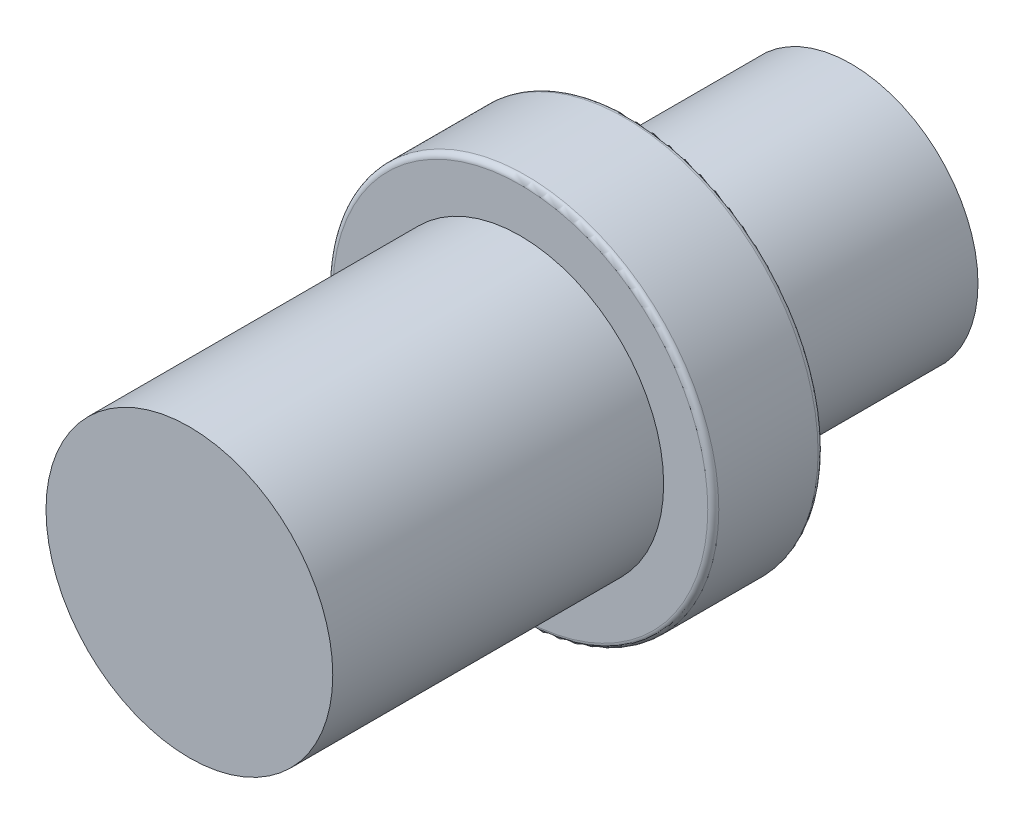
ISO-10303-21;
HEADER;
FILE_DESCRIPTION(('STEP AP214'),'2;1');
FILE_NAME('part.step','',(''),(''),'','','');
FILE_SCHEMA(('AUTOMOTIVE_DESIGN { 1 0 10303 214 1 1 1 1 }'));
ENDSEC;
DATA;
#1=APPLICATION_CONTEXT('core data for automotive mechanical design processes');
#2=APPLICATION_PROTOCOL_DEFINITION('international standard','automotive_design',2000,#1);
#3=PRODUCT_CONTEXT('',#1,'mechanical');
#4=PRODUCT('Part','Part','',(#3));
#5=PRODUCT_RELATED_PRODUCT_CATEGORY('part','',(#4));
#6=PRODUCT_DEFINITION_FORMATION('','',#4);
#7=PRODUCT_DEFINITION_CONTEXT('part definition',#1,'design');
#8=PRODUCT_DEFINITION('design','',#6,#7);
#9=PRODUCT_DEFINITION_SHAPE('','',#8);
#10=(LENGTH_UNIT() NAMED_UNIT(*) SI_UNIT(.MILLI.,.METRE.));
#11=(NAMED_UNIT(*) PLANE_ANGLE_UNIT() SI_UNIT($,.RADIAN.));
#12=(NAMED_UNIT(*) SI_UNIT($,.STERADIAN.) SOLID_ANGLE_UNIT());
#13=UNCERTAINTY_MEASURE_WITH_UNIT(LENGTH_MEASURE(1.E-05),#10,'distance_accuracy_value','');
#14=(GEOMETRIC_REPRESENTATION_CONTEXT(3) GLOBAL_UNCERTAINTY_ASSIGNED_CONTEXT((#13)) GLOBAL_UNIT_ASSIGNED_CONTEXT((#10,
#11,#12)) REPRESENTATION_CONTEXT('',''));
#15=CARTESIAN_POINT('',(0.,0.,0.));
#16=DIRECTION('',(0.,0.,1.));
#17=DIRECTION('',(1.,0.,0.));
#18=AXIS2_PLACEMENT_3D('',#15,#16,#17);
#19=CARTESIAN_POINT('',(0.,0.,20.));
#20=DIRECTION('',(0.,0.,-1.));
#21=DIRECTION('',(-1.,0.,0.));
#22=AXIS2_PLACEMENT_3D('',#19,#20,#21);
#23=CYLINDRICAL_SURFACE('',#22,11.5);
#24=CARTESIAN_POINT('',(0.,0.,20.));
#25=DIRECTION('',(0.,0.,1.));
#26=DIRECTION('',(1.,0.,0.));
#27=AXIS2_PLACEMENT_3D('',#24,#25,#26);
#28=CIRCLE('',#27,11.5);
#29=CARTESIAN_POINT('',(11.5,0.,20.));
#30=VERTEX_POINT('',#29);
#31=EDGE_CURVE('E66',#30,#30,#28,.T.);
#32=ORIENTED_EDGE('',*,*,#31,.F.);
#33=EDGE_LOOP('',(#32));
#34=FACE_BOUND('',#33,.T.);
#35=CARTESIAN_POINT('',(0.,0.,0.));
#36=DIRECTION('',(0.,0.,1.));
#37=DIRECTION('',(1.,0.,0.));
#38=AXIS2_PLACEMENT_3D('',#35,#36,#37);
#39=CIRCLE('',#38,11.5);
#40=CARTESIAN_POINT('',(11.5,0.,0.));
#41=VERTEX_POINT('',#40);
#42=EDGE_CURVE('E62',#41,#41,#39,.T.);
#43=ORIENTED_EDGE('',*,*,#42,.T.);
#44=EDGE_LOOP('',(#43));
#45=FACE_BOUND('',#44,.T.);
#46=ADVANCED_FACE('F37',(#34,#45),#23,.T.);
#47=CARTESIAN_POINT('',(0.,0.,0.));
#48=DIRECTION('',(0.,0.,1.));
#49=DIRECTION('',(1.,0.,0.));
#50=AXIS2_PLACEMENT_3D('',#47,#48,#49);
#51=PLANE('',#50);
#52=ORIENTED_EDGE('',*,*,#42,.F.);
#53=EDGE_LOOP('',(#52));
#54=FACE_BOUND('',#53,.T.);
#55=ADVANCED_FACE('F96',(#54),#51,.F.);
#56=CARTESIAN_POINT('',(0.,0.,30.));
#57=DIRECTION('',(0.,0.,-1.));
#58=DIRECTION('',(-1.,0.,0.));
#59=AXIS2_PLACEMENT_3D('',#56,#57,#58);
#60=CYLINDRICAL_SURFACE('',#59,17.5);
#61=CARTESIAN_POINT('',(0.,0.,20.5));
#62=DIRECTION('',(0.,0.,1.));
#63=DIRECTION('',(1.,0.,0.));
#64=AXIS2_PLACEMENT_3D('',#61,#62,#63);
#65=CIRCLE('',#64,17.5);
#66=CARTESIAN_POINT('',(17.5,0.,20.5));
#67=VERTEX_POINT('',#66);
#68=EDGE_CURVE('E50',#67,#67,#65,.T.);
#69=ORIENTED_EDGE('',*,*,#68,.T.);
#70=EDGE_LOOP('',(#69));
#71=FACE_BOUND('',#70,.T.);
#72=CARTESIAN_POINT('',(0.,0.,29.5));
#73=DIRECTION('',(0.,0.,1.));
#74=DIRECTION('',(1.,0.,0.));
#75=AXIS2_PLACEMENT_3D('',#72,#73,#74);
#76=CIRCLE('',#75,17.5);
#77=CARTESIAN_POINT('',(17.5,0.,29.5));
#78=VERTEX_POINT('',#77);
#79=EDGE_CURVE('E55',#78,#78,#76,.F.);
#80=ORIENTED_EDGE('',*,*,#79,.T.);
#81=EDGE_LOOP('',(#80));
#82=FACE_BOUND('',#81,.T.);
#83=ADVANCED_FACE('F89',(#71,#82),#60,.T.);
#84=CARTESIAN_POINT('',(0.,0.,30.));
#85=DIRECTION('',(0.,0.,1.));
#86=DIRECTION('',(1.,0.,0.));
#87=AXIS2_PLACEMENT_3D('',#84,#85,#86);
#88=PLANE('',#87);
#89=CARTESIAN_POINT('',(0.,0.,30.));
#90=DIRECTION('',(0.,0.,1.));
#91=DIRECTION('',(1.,0.,0.));
#92=AXIS2_PLACEMENT_3D('',#89,#90,#91);
#93=CIRCLE('',#92,17.);
#94=CARTESIAN_POINT('',(17.,0.,30.));
#95=VERTEX_POINT('',#94);
#96=EDGE_CURVE('E10',#95,#95,#93,.T.);
#97=ORIENTED_EDGE('',*,*,#96,.T.);
#98=EDGE_LOOP('',(#97));
#99=FACE_BOUND('',#98,.T.);
#100=CARTESIAN_POINT('',(0.,0.,30.));
#101=DIRECTION('',(0.,0.,1.));
#102=DIRECTION('',(1.,0.,0.));
#103=AXIS2_PLACEMENT_3D('',#100,#101,#102);
#104=CIRCLE('',#103,13.);
#105=CARTESIAN_POINT('',(13.,0.,30.));
#106=VERTEX_POINT('',#105);
#107=EDGE_CURVE('E61',#106,#106,#104,.T.);
#108=ORIENTED_EDGE('',*,*,#107,.F.);
#109=EDGE_LOOP('',(#108));
#110=FACE_BOUND('',#109,.T.);
#111=ADVANCED_FACE('F87',(#99,#110),#88,.T.);
#112=CARTESIAN_POINT('',(0.,0.,20.));
#113=DIRECTION('',(0.,0.,1.));
#114=DIRECTION('',(1.,0.,0.));
#115=AXIS2_PLACEMENT_3D('',#112,#113,#114);
#116=PLANE('',#115);
#117=CARTESIAN_POINT('',(0.,0.,20.));
#118=DIRECTION('',(0.,0.,1.));
#119=DIRECTION('',(1.,0.,0.));
#120=AXIS2_PLACEMENT_3D('',#117,#118,#119);
#121=CIRCLE('',#120,17.);
#122=CARTESIAN_POINT('',(17.,0.,20.));
#123=VERTEX_POINT('',#122);
#124=EDGE_CURVE('E45',#123,#123,#121,.F.);
#125=ORIENTED_EDGE('',*,*,#124,.T.);
#126=EDGE_LOOP('',(#125));
#127=FACE_BOUND('',#126,.T.);
#128=ORIENTED_EDGE('',*,*,#31,.T.);
#129=EDGE_LOOP('',(#128));
#130=FACE_BOUND('',#129,.T.);
#131=ADVANCED_FACE('F83',(#127,#130),#116,.F.);
#132=CARTESIAN_POINT('',(0.,0.,60.));
#133=DIRECTION('',(0.,0.,-1.));
#134=DIRECTION('',(-1.,0.,0.));
#135=AXIS2_PLACEMENT_3D('',#132,#133,#134);
#136=CYLINDRICAL_SURFACE('',#135,13.);
#137=CARTESIAN_POINT('',(0.,0.,60.));
#138=DIRECTION('',(0.,0.,1.));
#139=DIRECTION('',(1.,0.,0.));
#140=AXIS2_PLACEMENT_3D('',#137,#138,#139);
#141=CIRCLE('',#140,13.);
#142=CARTESIAN_POINT('',(13.,0.,60.));
#143=VERTEX_POINT('',#142);
#144=EDGE_CURVE('E67',#143,#143,#141,.T.);
#145=ORIENTED_EDGE('',*,*,#144,.F.);
#146=EDGE_LOOP('',(#145));
#147=FACE_BOUND('',#146,.T.);
#148=ORIENTED_EDGE('',*,*,#107,.T.);
#149=EDGE_LOOP('',(#148));
#150=FACE_BOUND('',#149,.T.);
#151=ADVANCED_FACE('F80',(#147,#150),#136,.T.);
#152=CARTESIAN_POINT('',(0.,0.,60.));
#153=DIRECTION('',(0.,0.,1.));
#154=DIRECTION('',(1.,0.,0.));
#155=AXIS2_PLACEMENT_3D('',#152,#153,#154);
#156=PLANE('',#155);
#157=ORIENTED_EDGE('',*,*,#144,.T.);
#158=EDGE_LOOP('',(#157));
#159=FACE_BOUND('',#158,.T.);
#160=ADVANCED_FACE('F78',(#159),#156,.T.);
#161=CARTESIAN_POINT('',(0.,0.,20.5));
#162=DIRECTION('',(0.,0.,1.));
#163=DIRECTION('',(1.,0.,0.));
#164=AXIS2_PLACEMENT_3D('',#161,#162,#163);
#165=TOROIDAL_SURFACE('',#164,17.,0.5);
#166=ORIENTED_EDGE('',*,*,#124,.F.);
#167=EDGE_LOOP('',(#166));
#168=FACE_BOUND('',#167,.T.);
#169=ORIENTED_EDGE('',*,*,#68,.F.);
#170=EDGE_LOOP('',(#169));
#171=FACE_BOUND('',#170,.T.);
#172=ADVANCED_FACE('F109',(#168,#171),#165,.T.);
#173=CARTESIAN_POINT('',(0.,0.,29.5));
#174=DIRECTION('',(0.,0.,1.));
#175=DIRECTION('',(1.,0.,0.));
#176=AXIS2_PLACEMENT_3D('',#173,#174,#175);
#177=TOROIDAL_SURFACE('',#176,17.,0.5);
#178=ORIENTED_EDGE('',*,*,#79,.F.);
#179=EDGE_LOOP('',(#178));
#180=FACE_BOUND('',#179,.T.);
#181=ORIENTED_EDGE('',*,*,#96,.F.);
#182=EDGE_LOOP('',(#181));
#183=FACE_BOUND('',#182,.T.);
#184=ADVANCED_FACE('F39',(#180,#183),#177,.T.);
#185=CLOSED_SHELL('',(#46,#55,#83,#111,#131,#151,#160,#172,#184));
#186=MANIFOLD_SOLID_BREP('B2',#185);
#187=ADVANCED_BREP_SHAPE_REPRESENTATION('',(#18,#186),#14);
#188=SHAPE_DEFINITION_REPRESENTATION(#9,#187);
ENDSEC;
END-ISO-10303-21;
